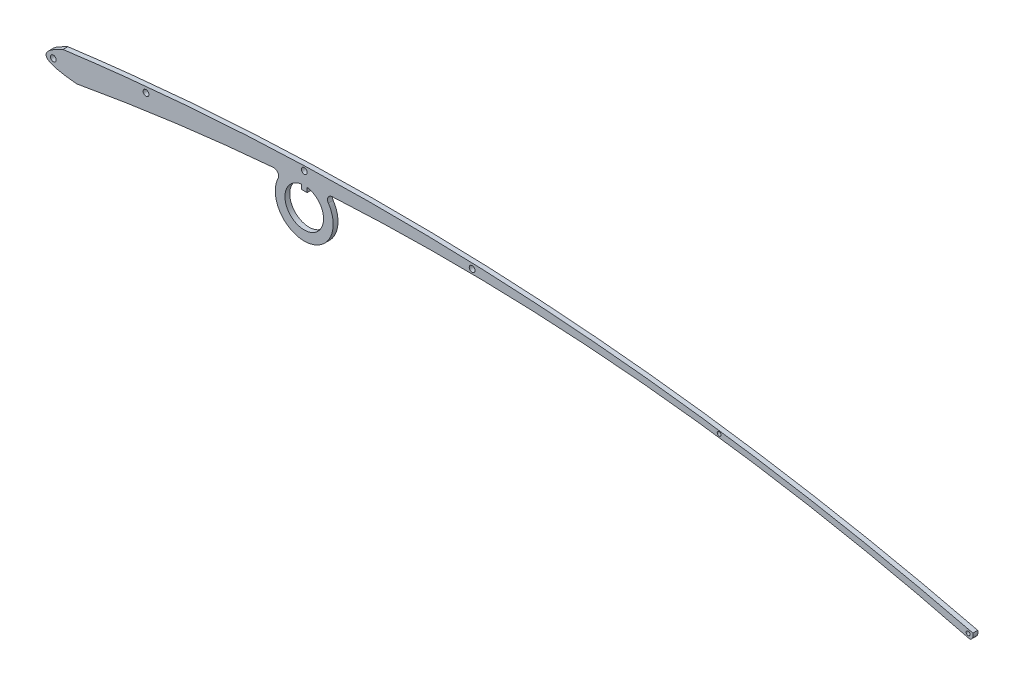
ISO-10303-21;
HEADER;
FILE_DESCRIPTION(('STEP AP214'),'2;1');
FILE_NAME('part.step','',(''),(''),'','','');
FILE_SCHEMA(('AUTOMOTIVE_DESIGN { 1 0 10303 214 1 1 1 1 }'));
ENDSEC;
DATA;
#1=APPLICATION_CONTEXT('core data for automotive mechanical design processes');
#2=APPLICATION_PROTOCOL_DEFINITION('international standard','automotive_design',2000,#1);
#3=PRODUCT_CONTEXT('',#1,'mechanical');
#4=PRODUCT('Part','Part','',(#3));
#5=PRODUCT_RELATED_PRODUCT_CATEGORY('part','',(#4));
#6=PRODUCT_DEFINITION_FORMATION('','',#4);
#7=PRODUCT_DEFINITION_CONTEXT('part definition',#1,'design');
#8=PRODUCT_DEFINITION('design','',#6,#7);
#9=PRODUCT_DEFINITION_SHAPE('','',#8);
#10=(LENGTH_UNIT() NAMED_UNIT(*) SI_UNIT(.MILLI.,.METRE.));
#11=(NAMED_UNIT(*) PLANE_ANGLE_UNIT() SI_UNIT($,.RADIAN.));
#12=(NAMED_UNIT(*) SI_UNIT($,.STERADIAN.) SOLID_ANGLE_UNIT());
#13=UNCERTAINTY_MEASURE_WITH_UNIT(LENGTH_MEASURE(1.E-05),#10,'distance_accuracy_value','');
#14=(GEOMETRIC_REPRESENTATION_CONTEXT(3) GLOBAL_UNCERTAINTY_ASSIGNED_CONTEXT((#13)) GLOBAL_UNIT_ASSIGNED_CONTEXT((#10,
#11,#12)) REPRESENTATION_CONTEXT('',''));
#15=CARTESIAN_POINT('',(0.,0.,0.));
#16=DIRECTION('',(0.,0.,1.));
#17=DIRECTION('',(1.,0.,0.));
#18=AXIS2_PLACEMENT_3D('',#15,#16,#17);
#19=CARTESIAN_POINT('',(1.4,-2.38,0.25));
#20=CARTESIAN_POINT('',(47.9545618267195,5.97686786365619,0.25));
#21=CARTESIAN_POINT('',(94.,-5.94,0.25));
#22=B_SPLINE_CURVE_WITH_KNOTS('',2,(#19,#20,#21),.UNSPECIFIED.,.F.,.F.,(3,3),(0.,1.),.UNSPECIFIED.);
#23=DIRECTION('',(0.,0.,-1.));
#24=VECTOR('',#23,1.);
#25=SURFACE_OF_LINEAR_EXTRUSION('',#22,#24);
#26=CARTESIAN_POINT('',(1.4,-2.38,-0.25));
#27=CARTESIAN_POINT('',(47.9545618267195,5.97686786365619,-0.25));
#28=CARTESIAN_POINT('',(94.,-5.94,-0.25));
#29=B_SPLINE_CURVE_WITH_KNOTS('',2,(#26,#27,#28),.UNSPECIFIED.,.F.,.F.,(3,3),(0.,1.),.UNSPECIFIED.);
#30=CARTESIAN_POINT('',(1.4,-2.38,-0.25));
#31=VERTEX_POINT('',#30);
#32=CARTESIAN_POINT('',(21.8018402597414,0.310938770262004,-0.25));
#33=VERTEX_POINT('',#32);
#34=EDGE_CURVE('E251',#31,#33,#29,.T.);
#35=ORIENTED_EDGE('',*,*,#34,.T.);
#36=DIRECTION('',(0.,0.,-1.));
#37=VECTOR('',#36,1.);
#38=CARTESIAN_POINT('',(21.8018402597414,0.310938770262003,-0.25));
#39=LINE('',#38,#37);
#40=CARTESIAN_POINT('',(21.8018402597414,0.310938770262004,0.25));
#41=VERTEX_POINT('',#40);
#42=EDGE_CURVE('E253',#33,#41,#39,.F.);
#43=ORIENTED_EDGE('',*,*,#42,.T.);
#44=CARTESIAN_POINT('',(1.4,-2.38,0.25));
#45=VERTEX_POINT('',#44);
#46=EDGE_CURVE('E214',#45,#41,#22,.T.);
#47=ORIENTED_EDGE('',*,*,#46,.F.);
#48=DIRECTION('',(0.,0.,-1.));
#49=VECTOR('',#48,1.);
#50=CARTESIAN_POINT('',(1.4,-2.38,0.25));
#51=LINE('',#50,#49);
#52=EDGE_CURVE('E256',#45,#31,#51,.T.);
#53=ORIENTED_EDGE('',*,*,#52,.T.);
#54=EDGE_LOOP('',(#35,#43,#47,#53));
#55=FACE_BOUND('',#54,.T.);
#56=ADVANCED_FACE('F34',(#55),#25,.F.);
#57=CARTESIAN_POINT('',(27.8873530453311,0.736269524725093,0.25));
#58=VERTEX_POINT('',#57);
#59=CARTESIAN_POINT('',(94.,-5.94,0.25));
#60=VERTEX_POINT('',#59);
#61=EDGE_CURVE('E212',#58,#60,#22,.T.);
#62=ORIENTED_EDGE('',*,*,#61,.F.);
#63=DIRECTION('',(0.,0.,-1.));
#64=VECTOR('',#63,1.);
#65=CARTESIAN_POINT('',(27.8873530453311,0.736269524725093,0.25));
#66=LINE('',#65,#64);
#67=CARTESIAN_POINT('',(27.8873530453311,0.736269524725093,-0.25));
#68=VERTEX_POINT('',#67);
#69=EDGE_CURVE('E267',#58,#68,#66,.T.);
#70=ORIENTED_EDGE('',*,*,#69,.T.);
#71=CARTESIAN_POINT('',(94.,-5.94,-0.25));
#72=VERTEX_POINT('',#71);
#73=EDGE_CURVE('E261',#68,#72,#29,.T.);
#74=ORIENTED_EDGE('',*,*,#73,.T.);
#75=DIRECTION('',(0.,0.,-1.));
#76=VECTOR('',#75,1.);
#77=CARTESIAN_POINT('',(94.,-5.94,0.25));
#78=LINE('',#77,#76);
#79=EDGE_CURVE('E284',#60,#72,#78,.T.);
#80=ORIENTED_EDGE('',*,*,#79,.F.);
#81=EDGE_LOOP('',(#62,#70,#74,#80));
#82=FACE_BOUND('',#81,.T.);
#83=ADVANCED_FACE('F227',(#82),#25,.F.);
#84=CARTESIAN_POINT('',(0.,0.,0.25));
#85=CARTESIAN_POINT('',(-4.123736473106,-1.85948761779572,0.25));
#86=CARTESIAN_POINT('',(1.4,-2.38,0.25));
#87=B_SPLINE_CURVE_WITH_KNOTS('',2,(#84,#85,#86),.UNSPECIFIED.,.F.,.F.,(3,3),(0.,1.),.UNSPECIFIED.);
#88=DIRECTION('',(0.,0.,-1.));
#89=VECTOR('',#88,1.);
#90=SURFACE_OF_LINEAR_EXTRUSION('',#87,#89);
#91=CARTESIAN_POINT('',(0.,0.,-0.25));
#92=CARTESIAN_POINT('',(-4.123736473106,-1.85948761779572,-0.25));
#93=CARTESIAN_POINT('',(1.4,-2.38,-0.25));
#94=B_SPLINE_CURVE_WITH_KNOTS('',2,(#91,#92,#93),.UNSPECIFIED.,.F.,.F.,(3,3),(0.,1.),.UNSPECIFIED.);
#95=CARTESIAN_POINT('',(0.,0.,-0.25));
#96=VERTEX_POINT('',#95);
#97=EDGE_CURVE('E173',#96,#31,#94,.T.);
#98=ORIENTED_EDGE('',*,*,#97,.T.);
#99=ORIENTED_EDGE('',*,*,#52,.F.);
#100=CARTESIAN_POINT('',(0.,0.,0.25));
#101=VERTEX_POINT('',#100);
#102=EDGE_CURVE('E206',#101,#45,#87,.T.);
#103=ORIENTED_EDGE('',*,*,#102,.F.);
#104=DIRECTION('',(0.,0.,-1.));
#105=VECTOR('',#104,1.);
#106=CARTESIAN_POINT('',(0.,0.,0.25));
#107=LINE('',#106,#105);
#108=EDGE_CURVE('E292',#101,#96,#107,.T.);
#109=ORIENTED_EDGE('',*,*,#108,.T.);
#110=EDGE_LOOP('',(#98,#99,#103,#109));
#111=FACE_BOUND('',#110,.T.);
#112=ADVANCED_FACE('F223',(#111),#90,.F.);
#113=CARTESIAN_POINT('',(93.7263979147297,-5.40601320340692,0.25));
#114=DIRECTION('',(0.,0.,-1.));
#115=DIRECTION('',(-1.,0.,0.));
#116=AXIS2_PLACEMENT_3D('',#113,#114,#115);
#117=CYLINDRICAL_SURFACE('',#116,0.599999999999999);
#118=CARTESIAN_POINT('',(93.7263979147297,-5.40601320340692,-0.25));
#119=DIRECTION('',(0.,0.,1.));
#120=DIRECTION('',(-1.,0.,0.));
#121=AXIS2_PLACEMENT_3D('',#118,#119,#120);
#122=CIRCLE('',#121,0.599999999999999);
#123=CARTESIAN_POINT('',(94.3,-5.23,-0.25));
#124=VERTEX_POINT('',#123);
#125=EDGE_CURVE('E260',#72,#124,#122,.T.);
#126=ORIENTED_EDGE('',*,*,#125,.T.);
#127=DIRECTION('',(0.,0.,-1.));
#128=VECTOR('',#127,1.);
#129=CARTESIAN_POINT('',(94.3,-5.23,0.25));
#130=LINE('',#129,#128);
#131=CARTESIAN_POINT('',(94.3,-5.23,0.25));
#132=VERTEX_POINT('',#131);
#133=EDGE_CURVE('E289',#132,#124,#130,.T.);
#134=ORIENTED_EDGE('',*,*,#133,.F.);
#135=CARTESIAN_POINT('',(93.7263979147297,-5.40601320340692,0.25));
#136=DIRECTION('',(0.,0.,1.));
#137=DIRECTION('',(-1.,0.,0.));
#138=AXIS2_PLACEMENT_3D('',#135,#136,#137);
#139=CIRCLE('',#138,0.599999999999999);
#140=EDGE_CURVE('E317',#60,#132,#139,.T.);
#141=ORIENTED_EDGE('',*,*,#140,.F.);
#142=ORIENTED_EDGE('',*,*,#79,.T.);
#143=EDGE_LOOP('',(#126,#134,#141,#142));
#144=FACE_BOUND('',#143,.T.);
#145=ADVANCED_FACE('F226',(#144),#117,.T.);
#146=CARTESIAN_POINT('',(94.3,-5.23,0.25));
#147=CARTESIAN_POINT('',(47.2732663174782,6.25577884848937,0.25));
#148=CARTESIAN_POINT('',(0.,0.,0.25));
#149=B_SPLINE_CURVE_WITH_KNOTS('',2,(#146,#147,#148),.UNSPECIFIED.,.F.,.F.,(3,3),(0.,1.),.UNSPECIFIED.);
#150=DIRECTION('',(0.,0.,-1.));
#151=VECTOR('',#150,1.);
#152=SURFACE_OF_LINEAR_EXTRUSION('',#149,#151);
#153=CARTESIAN_POINT('',(94.3,-5.23,-0.25));
#154=CARTESIAN_POINT('',(47.2732663174782,6.25577884848937,-0.25));
#155=CARTESIAN_POINT('',(0.,0.,-0.25));
#156=B_SPLINE_CURVE_WITH_KNOTS('',2,(#153,#154,#155),.UNSPECIFIED.,.F.,.F.,(3,3),(0.,1.),.UNSPECIFIED.);
#157=EDGE_CURVE('E213',#124,#96,#156,.T.);
#158=ORIENTED_EDGE('',*,*,#157,.T.);
#159=ORIENTED_EDGE('',*,*,#108,.F.);
#160=EDGE_CURVE('E295',#132,#101,#149,.T.);
#161=ORIENTED_EDGE('',*,*,#160,.F.);
#162=ORIENTED_EDGE('',*,*,#133,.T.);
#163=EDGE_LOOP('',(#158,#159,#161,#162));
#164=FACE_BOUND('',#163,.T.);
#165=ADVANCED_FACE('F322',(#164),#152,.F.);
#166=CARTESIAN_POINT('',(-1.711868236553,-1.52474380889786,0.25));
#167=DIRECTION('',(0.,0.,-1.));
#168=DIRECTION('',(-1.,0.,0.));
#169=AXIS2_PLACEMENT_3D('',#166,#167,#168);
#170=PLANE('',#169);
#171=CARTESIAN_POINT('',(-1.,-1.3,0.25));
#172=DIRECTION('',(0.,0.,1.));
#173=DIRECTION('',(1.,0.,0.));
#174=AXIS2_PLACEMENT_3D('',#171,#172,#173);
#175=CIRCLE('',#174,0.3);
#176=CARTESIAN_POINT('',(-0.7,-1.3,0.25));
#177=VERTEX_POINT('',#176);
#178=EDGE_CURVE('E174',#177,#177,#175,.T.);
#179=ORIENTED_EDGE('',*,*,#178,.F.);
#180=EDGE_LOOP('',(#179));
#181=FACE_BOUND('',#180,.T.);
#182=CARTESIAN_POINT('',(8.6,0.4,0.25));
#183=DIRECTION('',(0.,0.,1.));
#184=DIRECTION('',(1.,0.,0.));
#185=AXIS2_PLACEMENT_3D('',#182,#183,#184);
#186=CIRCLE('',#185,0.3);
#187=CARTESIAN_POINT('',(8.9,0.4,0.25));
#188=VERTEX_POINT('',#187);
#189=EDGE_CURVE('E180',#188,#188,#186,.T.);
#190=ORIENTED_EDGE('',*,*,#189,.F.);
#191=EDGE_LOOP('',(#190));
#192=FACE_BOUND('',#191,.T.);
#193=CARTESIAN_POINT('',(25.,1.6,0.25));
#194=DIRECTION('',(0.,0.,1.));
#195=DIRECTION('',(1.,0.,0.));
#196=AXIS2_PLACEMENT_3D('',#193,#194,#195);
#197=CIRCLE('',#196,0.300000000000004);
#198=CARTESIAN_POINT('',(25.3,1.6,0.25));
#199=VERTEX_POINT('',#198);
#200=EDGE_CURVE('E186',#199,#199,#197,.T.);
#201=ORIENTED_EDGE('',*,*,#200,.F.);
#202=EDGE_LOOP('',(#201));
#203=FACE_BOUND('',#202,.T.);
#204=CARTESIAN_POINT('',(42.4,1.5,0.25));
#205=DIRECTION('',(0.,0.,1.));
#206=DIRECTION('',(1.,0.,0.));
#207=AXIS2_PLACEMENT_3D('',#204,#205,#206);
#208=CIRCLE('',#207,0.300000000000004);
#209=CARTESIAN_POINT('',(42.7,1.5,0.25));
#210=VERTEX_POINT('',#209);
#211=EDGE_CURVE('E192',#210,#210,#208,.T.);
#212=ORIENTED_EDGE('',*,*,#211,.F.);
#213=EDGE_LOOP('',(#212));
#214=FACE_BOUND('',#213,.T.);
#215=CARTESIAN_POINT('',(68.,-0.5,0.25));
#216=DIRECTION('',(0.,0.,1.));
#217=DIRECTION('',(1.,0.,0.));
#218=AXIS2_PLACEMENT_3D('',#215,#216,#217);
#219=CIRCLE('',#218,0.199999999999988);
#220=CARTESIAN_POINT('',(68.2,-0.5,0.25));
#221=VERTEX_POINT('',#220);
#222=EDGE_CURVE('E198',#221,#221,#219,.T.);
#223=ORIENTED_EDGE('',*,*,#222,.F.);
#224=EDGE_LOOP('',(#223));
#225=FACE_BOUND('',#224,.T.);
#226=CARTESIAN_POINT('',(93.8,-5.5,0.25));
#227=DIRECTION('',(0.,0.,1.));
#228=DIRECTION('',(1.,0.,0.));
#229=AXIS2_PLACEMENT_3D('',#226,#227,#228);
#230=CIRCLE('',#229,0.200000000000003);
#231=CARTESIAN_POINT('',(94.,-5.5,0.25));
#232=VERTEX_POINT('',#231);
#233=EDGE_CURVE('E167',#232,#232,#230,.T.);
#234=ORIENTED_EDGE('',*,*,#233,.F.);
#235=EDGE_LOOP('',(#234));
#236=FACE_BOUND('',#235,.T.);
#237=ORIENTED_EDGE('',*,*,#102,.T.);
#238=ORIENTED_EDGE('',*,*,#46,.T.);
#239=CARTESIAN_POINT('',(21.8437780933207,-0.187299343609944,0.25));
#240=DIRECTION('',(0.,0.,-1.));
#241=DIRECTION('',(-1.,0.,0.));
#242=AXIS2_PLACEMENT_3D('',#239,#240,#241);
#243=CIRCLE('',#242,0.5);
#244=CARTESIAN_POINT('',(22.2946669371312,-0.40339943737956,0.25));
#245=VERTEX_POINT('',#244);
#246=EDGE_CURVE('E266',#41,#245,#243,.T.);
#247=ORIENTED_EDGE('',*,*,#246,.T.);
#248=CARTESIAN_POINT('',(25.,-1.7,0.25));
#249=DIRECTION('',(0.,0.,1.));
#250=DIRECTION('',(1.,0.,0.));
#251=AXIS2_PLACEMENT_3D('',#248,#249,#250);
#252=CIRCLE('',#251,3.00000000000644);
#253=CARTESIAN_POINT('',(27.498666781426,-0.0396794540099003,0.25));
#254=VERTEX_POINT('',#253);
#255=EDGE_CURVE('E165',#245,#254,#252,.T.);
#256=ORIENTED_EDGE('',*,*,#255,.T.);
#257=CARTESIAN_POINT('',(27.9151112449961,0.237040636987858,0.25));
#258=DIRECTION('',(0.,0.,-1.));
#259=DIRECTION('',(-1.,0.,0.));
#260=AXIS2_PLACEMENT_3D('',#257,#258,#259);
#261=CIRCLE('',#260,0.5);
#262=EDGE_CURVE('E11',#254,#58,#261,.T.);
#263=ORIENTED_EDGE('',*,*,#262,.T.);
#264=ORIENTED_EDGE('',*,*,#61,.T.);
#265=ORIENTED_EDGE('',*,*,#140,.T.);
#266=ORIENTED_EDGE('',*,*,#160,.T.);
#267=EDGE_LOOP('',(#237,#238,#247,#256,#263,#264,#265,#266));
#268=FACE_BOUND('',#267,.T.);
#269=DIRECTION('',(0.,-1.,0.));
#270=VECTOR('',#269,1.);
#271=CARTESIAN_POINT('',(25.3,0.277371993328519,0.25));
#272=LINE('',#271,#270);
#273=CARTESIAN_POINT('',(25.3,0.277371993328519,0.25));
#274=VERTEX_POINT('',#273);
#275=CARTESIAN_POINT('',(25.3,-0.2,0.25));
#276=VERTEX_POINT('',#275);
#277=EDGE_CURVE('E133',#274,#276,#272,.T.);
#278=ORIENTED_EDGE('',*,*,#277,.F.);
#279=CARTESIAN_POINT('',(25.,-1.7,0.25));
#280=DIRECTION('',(0.,0.,1.));
#281=DIRECTION('',(1.,0.,0.));
#282=AXIS2_PLACEMENT_3D('',#279,#280,#281);
#283=CIRCLE('',#282,2.);
#284=CARTESIAN_POINT('',(24.7,0.277371993328519,0.25));
#285=VERTEX_POINT('',#284);
#286=EDGE_CURVE('E123',#285,#274,#283,.T.);
#287=ORIENTED_EDGE('',*,*,#286,.F.);
#288=DIRECTION('',(0.,1.,0.));
#289=VECTOR('',#288,1.);
#290=CARTESIAN_POINT('',(24.7,0.277371993328519,0.25));
#291=LINE('',#290,#289);
#292=CARTESIAN_POINT('',(24.7,-0.2,0.25));
#293=VERTEX_POINT('',#292);
#294=EDGE_CURVE('E149',#293,#285,#291,.T.);
#295=ORIENTED_EDGE('',*,*,#294,.F.);
#296=DIRECTION('',(-1.,0.,0.));
#297=VECTOR('',#296,1.);
#298=CARTESIAN_POINT('',(24.7,-0.2,0.25));
#299=LINE('',#298,#297);
#300=EDGE_CURVE('E147',#276,#293,#299,.T.);
#301=ORIENTED_EDGE('',*,*,#300,.F.);
#302=EDGE_LOOP('',(#278,#287,#295,#301));
#303=FACE_BOUND('',#302,.T.);
#304=ADVANCED_FACE('F145',(#181,#192,#203,#214,#225,#236,#268,#303),#170,.F.);
#305=CARTESIAN_POINT('',(-1.711868236553,-1.52474380889786,-0.25));
#306=DIRECTION('',(0.,0.,-1.));
#307=DIRECTION('',(-1.,0.,0.));
#308=AXIS2_PLACEMENT_3D('',#305,#306,#307);
#309=PLANE('',#308);
#310=CARTESIAN_POINT('',(-1.,-1.3,-0.25));
#311=DIRECTION('',(0.,0.,1.));
#312=DIRECTION('',(1.,0.,0.));
#313=AXIS2_PLACEMENT_3D('',#310,#311,#312);
#314=CIRCLE('',#313,0.3);
#315=CARTESIAN_POINT('',(-0.7,-1.3,-0.25));
#316=VERTEX_POINT('',#315);
#317=EDGE_CURVE('E170',#316,#316,#314,.T.);
#318=ORIENTED_EDGE('',*,*,#317,.T.);
#319=EDGE_LOOP('',(#318));
#320=FACE_BOUND('',#319,.T.);
#321=CARTESIAN_POINT('',(8.6,0.4,-0.25));
#322=DIRECTION('',(0.,0.,1.));
#323=DIRECTION('',(1.,0.,0.));
#324=AXIS2_PLACEMENT_3D('',#321,#322,#323);
#325=CIRCLE('',#324,0.3);
#326=CARTESIAN_POINT('',(8.9,0.4,-0.25));
#327=VERTEX_POINT('',#326);
#328=EDGE_CURVE('E177',#327,#327,#325,.T.);
#329=ORIENTED_EDGE('',*,*,#328,.T.);
#330=EDGE_LOOP('',(#329));
#331=FACE_BOUND('',#330,.T.);
#332=CARTESIAN_POINT('',(25.,1.6,-0.25));
#333=DIRECTION('',(0.,0.,1.));
#334=DIRECTION('',(1.,0.,0.));
#335=AXIS2_PLACEMENT_3D('',#332,#333,#334);
#336=CIRCLE('',#335,0.300000000000004);
#337=CARTESIAN_POINT('',(25.3,1.6,-0.25));
#338=VERTEX_POINT('',#337);
#339=EDGE_CURVE('E183',#338,#338,#336,.T.);
#340=ORIENTED_EDGE('',*,*,#339,.T.);
#341=EDGE_LOOP('',(#340));
#342=FACE_BOUND('',#341,.T.);
#343=CARTESIAN_POINT('',(42.4,1.5,-0.25));
#344=DIRECTION('',(0.,0.,1.));
#345=DIRECTION('',(1.,0.,0.));
#346=AXIS2_PLACEMENT_3D('',#343,#344,#345);
#347=CIRCLE('',#346,0.300000000000004);
#348=CARTESIAN_POINT('',(42.7,1.5,-0.25));
#349=VERTEX_POINT('',#348);
#350=EDGE_CURVE('E189',#349,#349,#347,.T.);
#351=ORIENTED_EDGE('',*,*,#350,.T.);
#352=EDGE_LOOP('',(#351));
#353=FACE_BOUND('',#352,.T.);
#354=CARTESIAN_POINT('',(68.,-0.5,-0.25));
#355=DIRECTION('',(0.,0.,1.));
#356=DIRECTION('',(1.,0.,0.));
#357=AXIS2_PLACEMENT_3D('',#354,#355,#356);
#358=CIRCLE('',#357,0.199999999999988);
#359=CARTESIAN_POINT('',(68.2,-0.5,-0.25));
#360=VERTEX_POINT('',#359);
#361=EDGE_CURVE('E195',#360,#360,#358,.T.);
#362=ORIENTED_EDGE('',*,*,#361,.T.);
#363=EDGE_LOOP('',(#362));
#364=FACE_BOUND('',#363,.T.);
#365=CARTESIAN_POINT('',(93.8,-5.5,-0.25));
#366=DIRECTION('',(0.,0.,1.));
#367=DIRECTION('',(1.,0.,0.));
#368=AXIS2_PLACEMENT_3D('',#365,#366,#367);
#369=CIRCLE('',#368,0.200000000000003);
#370=CARTESIAN_POINT('',(94.,-5.5,-0.25));
#371=VERTEX_POINT('',#370);
#372=EDGE_CURVE('E201',#371,#371,#369,.T.);
#373=ORIENTED_EDGE('',*,*,#372,.T.);
#374=EDGE_LOOP('',(#373));
#375=FACE_BOUND('',#374,.T.);
#376=ORIENTED_EDGE('',*,*,#97,.F.);
#377=ORIENTED_EDGE('',*,*,#157,.F.);
#378=ORIENTED_EDGE('',*,*,#125,.F.);
#379=ORIENTED_EDGE('',*,*,#73,.F.);
#380=CARTESIAN_POINT('',(27.9151112449961,0.237040636987858,-0.25));
#381=DIRECTION('',(0.,0.,-1.));
#382=DIRECTION('',(-1.,0.,0.));
#383=AXIS2_PLACEMENT_3D('',#380,#381,#382);
#384=CIRCLE('',#383,0.5);
#385=CARTESIAN_POINT('',(27.498666781426,-0.0396794540099003,-0.25));
#386=VERTEX_POINT('',#385);
#387=EDGE_CURVE('E42',#68,#386,#384,.F.);
#388=ORIENTED_EDGE('',*,*,#387,.T.);
#389=CARTESIAN_POINT('',(25.,-1.7,-0.25));
#390=DIRECTION('',(0.,0.,1.));
#391=DIRECTION('',(1.,0.,0.));
#392=AXIS2_PLACEMENT_3D('',#389,#390,#391);
#393=CIRCLE('',#392,3.00000000000644);
#394=CARTESIAN_POINT('',(22.2946669371312,-0.40339943737956,-0.25));
#395=VERTEX_POINT('',#394);
#396=EDGE_CURVE('E141',#395,#386,#393,.T.);
#397=ORIENTED_EDGE('',*,*,#396,.F.);
#398=CARTESIAN_POINT('',(21.8437780933207,-0.187299343609944,-0.25));
#399=DIRECTION('',(0.,0.,-1.));
#400=DIRECTION('',(-1.,0.,0.));
#401=AXIS2_PLACEMENT_3D('',#398,#399,#400);
#402=CIRCLE('',#401,0.5);
#403=EDGE_CURVE('E264',#395,#33,#402,.F.);
#404=ORIENTED_EDGE('',*,*,#403,.T.);
#405=ORIENTED_EDGE('',*,*,#34,.F.);
#406=EDGE_LOOP('',(#376,#377,#378,#379,#388,#397,#404,#405));
#407=FACE_BOUND('',#406,.T.);
#408=CARTESIAN_POINT('',(25.,-1.7,-0.25));
#409=DIRECTION('',(0.,0.,1.));
#410=DIRECTION('',(1.,0.,0.));
#411=AXIS2_PLACEMENT_3D('',#408,#409,#410);
#412=CIRCLE('',#411,2.);
#413=CARTESIAN_POINT('',(24.7,0.277371993328519,-0.25));
#414=VERTEX_POINT('',#413);
#415=CARTESIAN_POINT('',(25.3,0.277371993328519,-0.25));
#416=VERTEX_POINT('',#415);
#417=EDGE_CURVE('E153',#414,#416,#412,.T.);
#418=ORIENTED_EDGE('',*,*,#417,.T.);
#419=DIRECTION('',(0.,-1.,0.));
#420=VECTOR('',#419,1.);
#421=CARTESIAN_POINT('',(25.3,0.277371993328519,-0.25));
#422=LINE('',#421,#420);
#423=CARTESIAN_POINT('',(25.3,-0.2,-0.25));
#424=VERTEX_POINT('',#423);
#425=EDGE_CURVE('E140',#416,#424,#422,.T.);
#426=ORIENTED_EDGE('',*,*,#425,.T.);
#427=DIRECTION('',(-1.,0.,0.));
#428=VECTOR('',#427,1.);
#429=CARTESIAN_POINT('',(24.7,-0.2,-0.25));
#430=LINE('',#429,#428);
#431=CARTESIAN_POINT('',(24.7,-0.2,-0.25));
#432=VERTEX_POINT('',#431);
#433=EDGE_CURVE('E156',#424,#432,#430,.T.);
#434=ORIENTED_EDGE('',*,*,#433,.T.);
#435=DIRECTION('',(0.,1.,0.));
#436=VECTOR('',#435,1.);
#437=CARTESIAN_POINT('',(24.7,0.277371993328519,-0.25));
#438=LINE('',#437,#436);
#439=EDGE_CURVE('E134',#432,#414,#438,.T.);
#440=ORIENTED_EDGE('',*,*,#439,.T.);
#441=EDGE_LOOP('',(#418,#426,#434,#440));
#442=FACE_BOUND('',#441,.T.);
#443=ADVANCED_FACE('F278',(#320,#331,#342,#353,#364,#375,#407,#442),#309,.T.);
#444=CARTESIAN_POINT('',(93.8,-5.5,-0.25));
#445=DIRECTION('',(0.,0.,1.));
#446=DIRECTION('',(1.,0.,0.));
#447=AXIS2_PLACEMENT_3D('',#444,#445,#446);
#448=CYLINDRICAL_SURFACE('',#447,0.200000000000003);
#449=ORIENTED_EDGE('',*,*,#372,.F.);
#450=EDGE_LOOP('',(#449));
#451=FACE_BOUND('',#450,.T.);
#452=ORIENTED_EDGE('',*,*,#233,.T.);
#453=EDGE_LOOP('',(#452));
#454=FACE_BOUND('',#453,.T.);
#455=ADVANCED_FACE('F343',(#451,#454),#448,.F.);
#456=CARTESIAN_POINT('',(68.,-0.5,-0.25));
#457=DIRECTION('',(0.,0.,1.));
#458=DIRECTION('',(1.,0.,0.));
#459=AXIS2_PLACEMENT_3D('',#456,#457,#458);
#460=CYLINDRICAL_SURFACE('',#459,0.199999999999988);
#461=ORIENTED_EDGE('',*,*,#361,.F.);
#462=EDGE_LOOP('',(#461));
#463=FACE_BOUND('',#462,.T.);
#464=ORIENTED_EDGE('',*,*,#222,.T.);
#465=EDGE_LOOP('',(#464));
#466=FACE_BOUND('',#465,.T.);
#467=ADVANCED_FACE('F350',(#463,#466),#460,.F.);
#468=CARTESIAN_POINT('',(42.4,1.5,-0.25));
#469=DIRECTION('',(0.,0.,1.));
#470=DIRECTION('',(1.,0.,0.));
#471=AXIS2_PLACEMENT_3D('',#468,#469,#470);
#472=CYLINDRICAL_SURFACE('',#471,0.300000000000004);
#473=ORIENTED_EDGE('',*,*,#350,.F.);
#474=EDGE_LOOP('',(#473));
#475=FACE_BOUND('',#474,.T.);
#476=ORIENTED_EDGE('',*,*,#211,.T.);
#477=EDGE_LOOP('',(#476));
#478=FACE_BOUND('',#477,.T.);
#479=ADVANCED_FACE('F354',(#475,#478),#472,.F.);
#480=CARTESIAN_POINT('',(25.,1.6,-0.25));
#481=DIRECTION('',(0.,0.,1.));
#482=DIRECTION('',(1.,0.,0.));
#483=AXIS2_PLACEMENT_3D('',#480,#481,#482);
#484=CYLINDRICAL_SURFACE('',#483,0.300000000000004);
#485=ORIENTED_EDGE('',*,*,#339,.F.);
#486=EDGE_LOOP('',(#485));
#487=FACE_BOUND('',#486,.T.);
#488=ORIENTED_EDGE('',*,*,#200,.T.);
#489=EDGE_LOOP('',(#488));
#490=FACE_BOUND('',#489,.T.);
#491=ADVANCED_FACE('F358',(#487,#490),#484,.F.);
#492=CARTESIAN_POINT('',(8.6,0.4,-0.25));
#493=DIRECTION('',(0.,0.,1.));
#494=DIRECTION('',(1.,0.,0.));
#495=AXIS2_PLACEMENT_3D('',#492,#493,#494);
#496=CYLINDRICAL_SURFACE('',#495,0.3);
#497=ORIENTED_EDGE('',*,*,#328,.F.);
#498=EDGE_LOOP('',(#497));
#499=FACE_BOUND('',#498,.T.);
#500=ORIENTED_EDGE('',*,*,#189,.T.);
#501=EDGE_LOOP('',(#500));
#502=FACE_BOUND('',#501,.T.);
#503=ADVANCED_FACE('F362',(#499,#502),#496,.F.);
#504=CARTESIAN_POINT('',(-1.,-1.3,-0.25));
#505=DIRECTION('',(0.,0.,1.));
#506=DIRECTION('',(1.,0.,0.));
#507=AXIS2_PLACEMENT_3D('',#504,#505,#506);
#508=CYLINDRICAL_SURFACE('',#507,0.3);
#509=ORIENTED_EDGE('',*,*,#317,.F.);
#510=EDGE_LOOP('',(#509));
#511=FACE_BOUND('',#510,.T.);
#512=ORIENTED_EDGE('',*,*,#178,.T.);
#513=EDGE_LOOP('',(#512));
#514=FACE_BOUND('',#513,.T.);
#515=ADVANCED_FACE('F366',(#511,#514),#508,.F.);
#516=CARTESIAN_POINT('',(25.,-1.7,0.25));
#517=DIRECTION('',(0.,0.,-1.));
#518=DIRECTION('',(-1.,0.,0.));
#519=AXIS2_PLACEMENT_3D('',#516,#517,#518);
#520=CYLINDRICAL_SURFACE('',#519,3.00000000000644);
#521=ORIENTED_EDGE('',*,*,#255,.F.);
#522=DIRECTION('',(0.,0.,-1.));
#523=VECTOR('',#522,1.);
#524=CARTESIAN_POINT('',(22.2946669371312,-0.403399437379559,0.25));
#525=LINE('',#524,#523);
#526=EDGE_CURVE('E268',#245,#395,#525,.T.);
#527=ORIENTED_EDGE('',*,*,#526,.T.);
#528=ORIENTED_EDGE('',*,*,#396,.T.);
#529=DIRECTION('',(0.,0.,-1.));
#530=VECTOR('',#529,1.);
#531=CARTESIAN_POINT('',(27.498666781426,-0.0396794540099001,0.25));
#532=LINE('',#531,#530);
#533=EDGE_CURVE('E271',#386,#254,#532,.F.);
#534=ORIENTED_EDGE('',*,*,#533,.T.);
#535=EDGE_LOOP('',(#521,#527,#528,#534));
#536=FACE_BOUND('',#535,.T.);
#537=ADVANCED_FACE('F283',(#536),#520,.T.);
#538=CARTESIAN_POINT('',(25.,-1.7,0.25));
#539=DIRECTION('',(0.,0.,-1.));
#540=DIRECTION('',(-1.,0.,0.));
#541=AXIS2_PLACEMENT_3D('',#538,#539,#540);
#542=CYLINDRICAL_SURFACE('',#541,2.);
#543=ORIENTED_EDGE('',*,*,#417,.F.);
#544=DIRECTION('',(0.,0.,-1.));
#545=VECTOR('',#544,1.);
#546=CARTESIAN_POINT('',(24.7,0.277371993328519,0.25));
#547=LINE('',#546,#545);
#548=EDGE_CURVE('E129',#285,#414,#547,.T.);
#549=ORIENTED_EDGE('',*,*,#548,.F.);
#550=ORIENTED_EDGE('',*,*,#286,.T.);
#551=DIRECTION('',(0.,0.,-1.));
#552=VECTOR('',#551,1.);
#553=CARTESIAN_POINT('',(25.3,0.277371993328519,0.25));
#554=LINE('',#553,#552);
#555=EDGE_CURVE('E126',#274,#416,#554,.T.);
#556=ORIENTED_EDGE('',*,*,#555,.T.);
#557=EDGE_LOOP('',(#543,#549,#550,#556));
#558=FACE_BOUND('',#557,.T.);
#559=ADVANCED_FACE('F125',(#558),#542,.F.);
#560=CARTESIAN_POINT('',(25.3,0.277371993328519,0.25));
#561=DIRECTION('',(1.,0.,0.));
#562=DIRECTION('',(0.,0.,-1.));
#563=AXIS2_PLACEMENT_3D('',#560,#561,#562);
#564=PLANE('',#563);
#565=ORIENTED_EDGE('',*,*,#425,.F.);
#566=ORIENTED_EDGE('',*,*,#555,.F.);
#567=ORIENTED_EDGE('',*,*,#277,.T.);
#568=DIRECTION('',(0.,0.,-1.));
#569=VECTOR('',#568,1.);
#570=CARTESIAN_POINT('',(25.3,-0.2,0.25));
#571=LINE('',#570,#569);
#572=EDGE_CURVE('E142',#276,#424,#571,.T.);
#573=ORIENTED_EDGE('',*,*,#572,.T.);
#574=EDGE_LOOP('',(#565,#566,#567,#573));
#575=FACE_BOUND('',#574,.T.);
#576=ADVANCED_FACE('F137',(#575),#564,.T.);
#577=CARTESIAN_POINT('',(24.7,-0.2,0.25));
#578=DIRECTION('',(0.,-1.,0.));
#579=DIRECTION('',(0.,0.,-1.));
#580=AXIS2_PLACEMENT_3D('',#577,#578,#579);
#581=PLANE('',#580);
#582=ORIENTED_EDGE('',*,*,#433,.F.);
#583=ORIENTED_EDGE('',*,*,#572,.F.);
#584=ORIENTED_EDGE('',*,*,#300,.T.);
#585=DIRECTION('',(0.,0.,-1.));
#586=VECTOR('',#585,1.);
#587=CARTESIAN_POINT('',(24.7,-0.2,0.25));
#588=LINE('',#587,#586);
#589=EDGE_CURVE('E162',#293,#432,#588,.T.);
#590=ORIENTED_EDGE('',*,*,#589,.T.);
#591=EDGE_LOOP('',(#582,#583,#584,#590));
#592=FACE_BOUND('',#591,.T.);
#593=ADVANCED_FACE('F238',(#592),#581,.T.);
#594=CARTESIAN_POINT('',(24.7,0.277371993328519,0.25));
#595=DIRECTION('',(-1.,0.,0.));
#596=DIRECTION('',(0.,0.,1.));
#597=AXIS2_PLACEMENT_3D('',#594,#595,#596);
#598=PLANE('',#597);
#599=ORIENTED_EDGE('',*,*,#439,.F.);
#600=ORIENTED_EDGE('',*,*,#589,.F.);
#601=ORIENTED_EDGE('',*,*,#294,.T.);
#602=ORIENTED_EDGE('',*,*,#548,.T.);
#603=EDGE_LOOP('',(#599,#600,#601,#602));
#604=FACE_BOUND('',#603,.T.);
#605=ADVANCED_FACE('F232',(#604),#598,.T.);
#606=CARTESIAN_POINT('',(21.8437780933207,-0.187299343609944,0.));
#607=DIRECTION('',(0.,0.,-1.));
#608=DIRECTION('',(-1.,0.,0.));
#609=AXIS2_PLACEMENT_3D('',#606,#607,#608);
#610=CYLINDRICAL_SURFACE('',#609,0.5);
#611=ORIENTED_EDGE('',*,*,#246,.F.);
#612=ORIENTED_EDGE('',*,*,#42,.F.);
#613=ORIENTED_EDGE('',*,*,#403,.F.);
#614=ORIENTED_EDGE('',*,*,#526,.F.);
#615=EDGE_LOOP('',(#611,#612,#613,#614));
#616=FACE_BOUND('',#615,.T.);
#617=ADVANCED_FACE('F230',(#616),#610,.F.);
#618=CARTESIAN_POINT('',(27.9151112449961,0.237040636987858,0.));
#619=DIRECTION('',(0.,0.,-1.));
#620=DIRECTION('',(-1.,0.,0.));
#621=AXIS2_PLACEMENT_3D('',#618,#619,#620);
#622=CYLINDRICAL_SURFACE('',#621,0.5);
#623=ORIENTED_EDGE('',*,*,#262,.F.);
#624=ORIENTED_EDGE('',*,*,#533,.F.);
#625=ORIENTED_EDGE('',*,*,#387,.F.);
#626=ORIENTED_EDGE('',*,*,#69,.F.);
#627=EDGE_LOOP('',(#623,#624,#625,#626));
#628=FACE_BOUND('',#627,.T.);
#629=ADVANCED_FACE('F36',(#628),#622,.F.);
#630=CLOSED_SHELL('',(#56,#83,#112,#145,#165,#304,#443,#455,#467,#479,#491,#503,#515,#537,#559,
#576,#593,#605,#617,#629));
#631=MANIFOLD_SOLID_BREP('B2',#630);
#632=ADVANCED_BREP_SHAPE_REPRESENTATION('',(#18,#631),#14);
#633=SHAPE_DEFINITION_REPRESENTATION(#9,#632);
ENDSEC;
END-ISO-10303-21;
